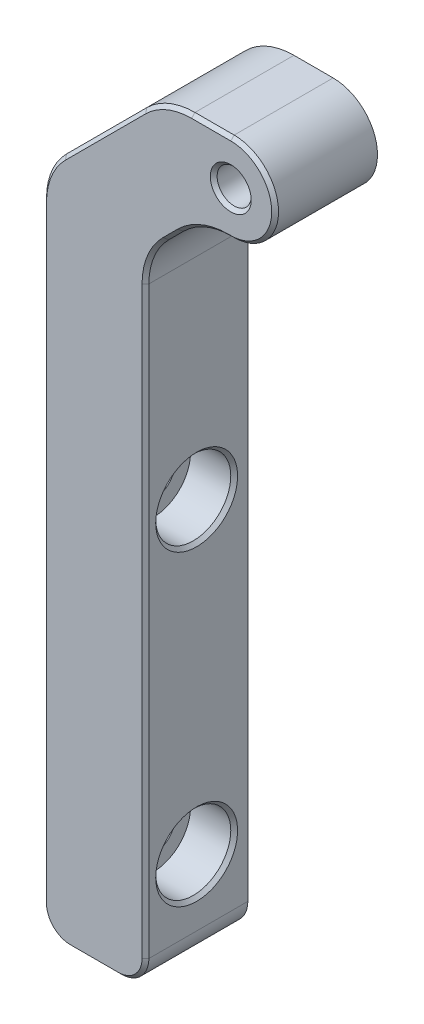
ISO-10303-21;
HEADER;
FILE_DESCRIPTION(('STEP AP214'),'2;1');
FILE_NAME('part.step','',(''),(''),'','','');
FILE_SCHEMA(('AUTOMOTIVE_DESIGN { 1 0 10303 214 1 1 1 1 }'));
ENDSEC;
DATA;
#1=APPLICATION_CONTEXT('core data for automotive mechanical design processes');
#2=APPLICATION_PROTOCOL_DEFINITION('international standard','automotive_design',2000,#1);
#3=PRODUCT_CONTEXT('',#1,'mechanical');
#4=PRODUCT('Part','Part','',(#3));
#5=PRODUCT_RELATED_PRODUCT_CATEGORY('part','',(#4));
#6=PRODUCT_DEFINITION_FORMATION('','',#4);
#7=PRODUCT_DEFINITION_CONTEXT('part definition',#1,'design');
#8=PRODUCT_DEFINITION('design','',#6,#7);
#9=PRODUCT_DEFINITION_SHAPE('','',#8);
#10=(LENGTH_UNIT() NAMED_UNIT(*) SI_UNIT(.MILLI.,.METRE.));
#11=(NAMED_UNIT(*) PLANE_ANGLE_UNIT() SI_UNIT($,.RADIAN.));
#12=(NAMED_UNIT(*) SI_UNIT($,.STERADIAN.) SOLID_ANGLE_UNIT());
#13=UNCERTAINTY_MEASURE_WITH_UNIT(LENGTH_MEASURE(1.E-05),#10,'distance_accuracy_value','');
#14=(GEOMETRIC_REPRESENTATION_CONTEXT(3) GLOBAL_UNCERTAINTY_ASSIGNED_CONTEXT((#13)) GLOBAL_UNIT_ASSIGNED_CONTEXT((#10,
#11,#12)) REPRESENTATION_CONTEXT('',''));
#15=CARTESIAN_POINT('',(0.,0.,0.));
#16=DIRECTION('',(0.,0.,1.));
#17=DIRECTION('',(1.,0.,0.));
#18=AXIS2_PLACEMENT_3D('',#15,#16,#17);
#19=CARTESIAN_POINT('',(26.4140960718114,32.7908047863379,15.));
#20=DIRECTION('',(0.,0.,-1.));
#21=DIRECTION('',(-1.,0.,0.));
#22=AXIS2_PLACEMENT_3D('',#19,#20,#21);
#23=CYLINDRICAL_SURFACE('',#22,6.49999999999695);
#24=DIRECTION('',(0.,0.,-1.));
#25=VECTOR('',#24,1.);
#26=CARTESIAN_POINT('',(26.4140960718114,39.2908047863348,15.));
#27=LINE('',#26,#25);
#28=CARTESIAN_POINT('',(26.4140960718114,39.2908047863348,14.5));
#29=VERTEX_POINT('',#28);
#30=CARTESIAN_POINT('',(26.4140960718114,39.2908047863348,0.));
#31=VERTEX_POINT('',#30);
#32=EDGE_CURVE('E177',#29,#31,#27,.T.);
#33=ORIENTED_EDGE('',*,*,#32,.F.);
#34=CARTESIAN_POINT('',(26.4140960718114,32.7908047863379,14.5));
#35=DIRECTION('',(0.,0.,1.));
#36=DIRECTION('',(1.,0.,0.));
#37=AXIS2_PLACEMENT_3D('',#34,#35,#36);
#38=CIRCLE('',#37,6.49999999999695);
#39=CARTESIAN_POINT('',(26.4140960718114,26.2908047863409,14.5));
#40=VERTEX_POINT('',#39);
#41=EDGE_CURVE('E323',#29,#40,#38,.F.);
#42=ORIENTED_EDGE('',*,*,#41,.T.);
#43=DIRECTION('',(0.,0.,-1.));
#44=VECTOR('',#43,1.);
#45=CARTESIAN_POINT('',(26.4140960718114,26.2908047863409,15.));
#46=LINE('',#45,#44);
#47=CARTESIAN_POINT('',(26.4140960718114,26.2908047863409,0.));
#48=VERTEX_POINT('',#47);
#49=EDGE_CURVE('E201',#40,#48,#46,.T.);
#50=ORIENTED_EDGE('',*,*,#49,.T.);
#51=CARTESIAN_POINT('',(26.4140960718114,32.7908047863379,0.));
#52=DIRECTION('',(0.,0.,1.));
#53=DIRECTION('',(1.,0.,0.));
#54=AXIS2_PLACEMENT_3D('',#51,#52,#53);
#55=CIRCLE('',#54,6.49999999999695);
#56=EDGE_CURVE('E195',#48,#31,#55,.T.);
#57=ORIENTED_EDGE('',*,*,#56,.T.);
#58=EDGE_LOOP('',(#33,#42,#50,#57));
#59=FACE_BOUND('',#58,.T.);
#60=ADVANCED_FACE('F32',(#59),#23,.T.);
#61=CARTESIAN_POINT('',(26.4140960718114,39.2908047863348,15.));
#62=DIRECTION('',(0.,-1.,0.));
#63=DIRECTION('',(0.,0.,-1.));
#64=AXIS2_PLACEMENT_3D('',#61,#62,#63);
#65=PLANE('',#64);
#66=DIRECTION('',(0.,0.,-1.));
#67=VECTOR('',#66,1.);
#68=CARTESIAN_POINT('',(20.6714553846794,39.2908047863348,15.));
#69=LINE('',#68,#67);
#70=CARTESIAN_POINT('',(20.6714553846794,39.2908047863348,14.5));
#71=VERTEX_POINT('',#70);
#72=CARTESIAN_POINT('',(20.6714553846794,39.2908047863348,0.));
#73=VERTEX_POINT('',#72);
#74=EDGE_CURVE('E189',#71,#73,#69,.T.);
#75=ORIENTED_EDGE('',*,*,#74,.F.);
#76=DIRECTION('',(1.,0.,0.));
#77=VECTOR('',#76,1.);
#78=CARTESIAN_POINT('',(26.4140960718114,39.2908047863348,14.5));
#79=LINE('',#78,#77);
#80=EDGE_CURVE('E184',#71,#29,#79,.T.);
#81=ORIENTED_EDGE('',*,*,#80,.T.);
#82=ORIENTED_EDGE('',*,*,#32,.T.);
#83=DIRECTION('',(-1.,0.,0.));
#84=VECTOR('',#83,1.);
#85=CARTESIAN_POINT('',(26.4140960718114,39.2908047863348,0.));
#86=LINE('',#85,#84);
#87=EDGE_CURVE('E181',#31,#73,#86,.T.);
#88=ORIENTED_EDGE('',*,*,#87,.T.);
#89=EDGE_LOOP('',(#75,#81,#82,#88));
#90=FACE_BOUND('',#89,.T.);
#91=ADVANCED_FACE('F180',(#90),#65,.F.);
#92=CARTESIAN_POINT('',(20.6714553846793,29.2908047863348,15.));
#93=DIRECTION('',(0.,0.,-1.));
#94=DIRECTION('',(-1.,0.,0.));
#95=AXIS2_PLACEMENT_3D('',#92,#93,#94);
#96=CYLINDRICAL_SURFACE('',#95,10.);
#97=DIRECTION('',(0.,0.,-1.));
#98=VECTOR('',#97,1.);
#99=CARTESIAN_POINT('',(13.6003875728138,36.3618725982003,15.));
#100=LINE('',#99,#98);
#101=CARTESIAN_POINT('',(13.6003875728138,36.3618725982003,14.5));
#102=VERTEX_POINT('',#101);
#103=CARTESIAN_POINT('',(13.6003875728138,36.3618725982003,0.));
#104=VERTEX_POINT('',#103);
#105=EDGE_CURVE('E264',#102,#104,#100,.T.);
#106=ORIENTED_EDGE('',*,*,#105,.F.);
#107=CARTESIAN_POINT('',(20.6714553846793,29.2908047863348,14.5));
#108=DIRECTION('',(0.,0.,1.));
#109=DIRECTION('',(1.,0.,0.));
#110=AXIS2_PLACEMENT_3D('',#107,#108,#109);
#111=CIRCLE('',#110,10.);
#112=EDGE_CURVE('E315',#102,#71,#111,.F.);
#113=ORIENTED_EDGE('',*,*,#112,.T.);
#114=ORIENTED_EDGE('',*,*,#74,.T.);
#115=CARTESIAN_POINT('',(20.6714553846793,29.2908047863348,0.));
#116=DIRECTION('',(0.,0.,1.));
#117=DIRECTION('',(1.,0.,0.));
#118=AXIS2_PLACEMENT_3D('',#115,#116,#117);
#119=CIRCLE('',#118,10.);
#120=EDGE_CURVE('E198',#73,#104,#119,.T.);
#121=ORIENTED_EDGE('',*,*,#120,.T.);
#122=EDGE_LOOP('',(#106,#113,#114,#121));
#123=FACE_BOUND('',#122,.T.);
#124=ADVANCED_FACE('F432',(#123),#96,.T.);
#125=CARTESIAN_POINT('',(13.6003875728138,36.3618725982003,15.));
#126=DIRECTION('',(0.707106781186547,-0.707106781186547,0.));
#127=DIRECTION('',(0.707106781186548,0.707106781186548,0.));
#128=AXIS2_PLACEMENT_3D('',#125,#126,#127);
#129=PLANE('',#128);
#130=DIRECTION('',(0.,0.,-1.));
#131=VECTOR('',#130,1.);
#132=CARTESIAN_POINT('',(1.84302825994298,24.6045132853294,15.));
#133=LINE('',#132,#131);
#134=CARTESIAN_POINT('',(1.84302825994298,24.6045132853294,14.5));
#135=VERTEX_POINT('',#134);
#136=CARTESIAN_POINT('',(1.84302825994298,24.6045132853294,0.));
#137=VERTEX_POINT('',#136);
#138=EDGE_CURVE('E262',#135,#137,#133,.T.);
#139=ORIENTED_EDGE('',*,*,#138,.F.);
#140=DIRECTION('',(0.707106781186548,0.707106781186548,0.));
#141=VECTOR('',#140,1.);
#142=CARTESIAN_POINT('',(13.6003875728138,36.3618725982003,14.5));
#143=LINE('',#142,#141);
#144=EDGE_CURVE('E318',#135,#102,#143,.T.);
#145=ORIENTED_EDGE('',*,*,#144,.T.);
#146=ORIENTED_EDGE('',*,*,#105,.T.);
#147=DIRECTION('',(-0.707106781186547,-0.707106781186547,0.));
#148=VECTOR('',#147,1.);
#149=CARTESIAN_POINT('',(13.6003875728138,36.3618725982003,0.));
#150=LINE('',#149,#148);
#151=EDGE_CURVE('E211',#104,#137,#150,.T.);
#152=ORIENTED_EDGE('',*,*,#151,.T.);
#153=EDGE_LOOP('',(#139,#145,#146,#152));
#154=FACE_BOUND('',#153,.T.);
#155=ADVANCED_FACE('F548',(#154),#129,.F.);
#156=CARTESIAN_POINT('',(8.91409607180843,17.5334454734639,15.));
#157=DIRECTION('',(0.,0.,-1.));
#158=DIRECTION('',(-1.,0.,0.));
#159=AXIS2_PLACEMENT_3D('',#156,#157,#158);
#160=CYLINDRICAL_SURFACE('',#159,10.);
#161=DIRECTION('',(0.,0.,-1.));
#162=VECTOR('',#161,1.);
#163=CARTESIAN_POINT('',(-1.08590392819157,17.5334454734639,15.));
#164=LINE('',#163,#162);
#165=CARTESIAN_POINT('',(-1.08590392819157,17.5334454734639,14.5));
#166=VERTEX_POINT('',#165);
#167=CARTESIAN_POINT('',(-1.08590392819157,17.5334454734639,0.));
#168=VERTEX_POINT('',#167);
#169=EDGE_CURVE('E260',#166,#168,#164,.T.);
#170=ORIENTED_EDGE('',*,*,#169,.F.);
#171=CARTESIAN_POINT('',(8.91409607180843,17.5334454734639,14.5));
#172=DIRECTION('',(0.,0.,1.));
#173=DIRECTION('',(1.,0.,0.));
#174=AXIS2_PLACEMENT_3D('',#171,#172,#173);
#175=CIRCLE('',#174,10.);
#176=EDGE_CURVE('E321',#166,#135,#175,.F.);
#177=ORIENTED_EDGE('',*,*,#176,.T.);
#178=ORIENTED_EDGE('',*,*,#138,.T.);
#179=CARTESIAN_POINT('',(8.91409607180843,17.5334454734639,0.));
#180=DIRECTION('',(0.,0.,1.));
#181=DIRECTION('',(1.,0.,0.));
#182=AXIS2_PLACEMENT_3D('',#179,#180,#181);
#183=CIRCLE('',#182,10.);
#184=EDGE_CURVE('E214',#137,#168,#183,.T.);
#185=ORIENTED_EDGE('',*,*,#184,.T.);
#186=EDGE_LOOP('',(#170,#177,#178,#185));
#187=FACE_BOUND('',#186,.T.);
#188=ADVANCED_FACE('F544',(#187),#160,.T.);
#189=CARTESIAN_POINT('',(-1.08590392819158,-71.4592049495357,15.));
#190=DIRECTION('',(1.,0.,0.));
#191=DIRECTION('',(0.,0.,-1.));
#192=AXIS2_PLACEMENT_3D('',#189,#190,#191);
#193=PLANE('',#192);
#194=CARTESIAN_POINT('',(-1.08590392819158,-16.7091952136652,7.49999999999999));
#195=DIRECTION('',(1.,0.,0.));
#196=DIRECTION('',(0.,0.,-1.));
#197=AXIS2_PLACEMENT_3D('',#194,#195,#196);
#198=CIRCLE('',#197,3.3);
#199=CARTESIAN_POINT('',(-1.08590392819158,-16.7091952136652,4.19999999999999));
#200=VERTEX_POINT('',#199);
#201=EDGE_CURVE('E387',#200,#200,#198,.T.);
#202=ORIENTED_EDGE('',*,*,#201,.T.);
#203=EDGE_LOOP('',(#202));
#204=FACE_BOUND('',#203,.T.);
#205=CARTESIAN_POINT('',(-1.08590392819158,-61.7091952136652,7.49999999999999));
#206=DIRECTION('',(1.,0.,0.));
#207=DIRECTION('',(0.,0.,-1.));
#208=AXIS2_PLACEMENT_3D('',#205,#206,#207);
#209=CIRCLE('',#208,3.3);
#210=CARTESIAN_POINT('',(-1.08590392819158,-61.7091952136652,4.19999999999999));
#211=VERTEX_POINT('',#210);
#212=EDGE_CURVE('E206',#211,#211,#209,.T.);
#213=ORIENTED_EDGE('',*,*,#212,.T.);
#214=EDGE_LOOP('',(#213));
#215=FACE_BOUND('',#214,.T.);
#216=DIRECTION('',(0.,0.,-1.));
#217=VECTOR('',#216,1.);
#218=CARTESIAN_POINT('',(-1.08590392819158,-71.4592049495357,15.));
#219=LINE('',#218,#217);
#220=CARTESIAN_POINT('',(-1.08590392819158,-71.4592049495357,14.5));
#221=VERTEX_POINT('',#220);
#222=CARTESIAN_POINT('',(-1.08590392819158,-71.4592049495357,0.));
#223=VERTEX_POINT('',#222);
#224=EDGE_CURVE('E258',#221,#223,#219,.T.);
#225=ORIENTED_EDGE('',*,*,#224,.F.);
#226=DIRECTION('',(0.,1.,0.));
#227=VECTOR('',#226,1.);
#228=CARTESIAN_POINT('',(-1.08590392819158,17.5334454734639,14.5));
#229=LINE('',#228,#227);
#230=EDGE_CURVE('E325',#221,#166,#229,.T.);
#231=ORIENTED_EDGE('',*,*,#230,.T.);
#232=ORIENTED_EDGE('',*,*,#169,.T.);
#233=DIRECTION('',(0.,-1.,0.));
#234=VECTOR('',#233,1.);
#235=CARTESIAN_POINT('',(-1.08590392819158,-71.4592049495357,0.));
#236=LINE('',#235,#234);
#237=EDGE_CURVE('E217',#168,#223,#236,.T.);
#238=ORIENTED_EDGE('',*,*,#237,.T.);
#239=EDGE_LOOP('',(#225,#231,#232,#238));
#240=FACE_BOUND('',#239,.T.);
#241=ADVANCED_FACE('F400',(#204,#215,#240),#193,.F.);
#242=CARTESIAN_POINT('',(2.91409607180843,-71.4592049495357,15.));
#243=DIRECTION('',(0.,0.,-1.));
#244=DIRECTION('',(-1.,0.,0.));
#245=AXIS2_PLACEMENT_3D('',#242,#243,#244);
#246=CYLINDRICAL_SURFACE('',#245,4.);
#247=DIRECTION('',(0.,0.,-1.));
#248=VECTOR('',#247,1.);
#249=CARTESIAN_POINT('',(2.91409607180843,-75.4592049495357,15.));
#250=LINE('',#249,#248);
#251=CARTESIAN_POINT('',(2.91409607180843,-75.4592049495357,14.5));
#252=VERTEX_POINT('',#251);
#253=CARTESIAN_POINT('',(2.91409607180843,-75.4592049495357,0.));
#254=VERTEX_POINT('',#253);
#255=EDGE_CURVE('E256',#252,#254,#250,.T.);
#256=ORIENTED_EDGE('',*,*,#255,.F.);
#257=CARTESIAN_POINT('',(2.91409607180843,-71.4592049495357,14.5));
#258=DIRECTION('',(0.,0.,1.));
#259=DIRECTION('',(1.,0.,0.));
#260=AXIS2_PLACEMENT_3D('',#257,#258,#259);
#261=CIRCLE('',#260,4.);
#262=EDGE_CURVE('E329',#252,#221,#261,.F.);
#263=ORIENTED_EDGE('',*,*,#262,.T.);
#264=ORIENTED_EDGE('',*,*,#224,.T.);
#265=CARTESIAN_POINT('',(2.91409607180843,-71.4592049495357,0.));
#266=DIRECTION('',(0.,0.,1.));
#267=DIRECTION('',(-1.,0.,0.));
#268=AXIS2_PLACEMENT_3D('',#265,#266,#267);
#269=CIRCLE('',#268,4.);
#270=EDGE_CURVE('E220',#223,#254,#269,.T.);
#271=ORIENTED_EDGE('',*,*,#270,.T.);
#272=EDGE_LOOP('',(#256,#263,#264,#271));
#273=FACE_BOUND('',#272,.T.);
#274=ADVANCED_FACE('F514',(#273),#246,.T.);
#275=CARTESIAN_POINT('',(2.91409607180843,-75.4592049495357,15.));
#276=DIRECTION('',(0.,1.,0.));
#277=DIRECTION('',(0.,0.,1.));
#278=AXIS2_PLACEMENT_3D('',#275,#276,#277);
#279=PLANE('',#278);
#280=DIRECTION('',(0.,0.,-1.));
#281=VECTOR('',#280,1.);
#282=CARTESIAN_POINT('',(9.91409607180471,-75.4592049495357,15.));
#283=LINE('',#282,#281);
#284=CARTESIAN_POINT('',(9.91409607180471,-75.4592049495357,14.5));
#285=VERTEX_POINT('',#284);
#286=CARTESIAN_POINT('',(9.91409607180471,-75.4592049495357,0.));
#287=VERTEX_POINT('',#286);
#288=EDGE_CURVE('E254',#285,#287,#283,.T.);
#289=ORIENTED_EDGE('',*,*,#288,.F.);
#290=DIRECTION('',(-1.,0.,0.));
#291=VECTOR('',#290,1.);
#292=CARTESIAN_POINT('',(2.91409607180843,-75.4592049495357,14.5));
#293=LINE('',#292,#291);
#294=EDGE_CURVE('E333',#285,#252,#293,.T.);
#295=ORIENTED_EDGE('',*,*,#294,.T.);
#296=ORIENTED_EDGE('',*,*,#255,.T.);
#297=DIRECTION('',(1.,0.,0.));
#298=VECTOR('',#297,1.);
#299=CARTESIAN_POINT('',(2.91409607180843,-75.4592049495357,0.));
#300=LINE('',#299,#298);
#301=EDGE_CURVE('E223',#254,#287,#300,.T.);
#302=ORIENTED_EDGE('',*,*,#301,.T.);
#303=EDGE_LOOP('',(#289,#295,#296,#302));
#304=FACE_BOUND('',#303,.T.);
#305=ADVANCED_FACE('F512',(#304),#279,.F.);
#306=CARTESIAN_POINT('',(9.91409607180471,-71.4592049495357,15.));
#307=DIRECTION('',(0.,0.,-1.));
#308=DIRECTION('',(-1.,0.,0.));
#309=AXIS2_PLACEMENT_3D('',#306,#307,#308);
#310=CYLINDRICAL_SURFACE('',#309,4.);
#311=DIRECTION('',(0.,0.,-1.));
#312=VECTOR('',#311,1.);
#313=CARTESIAN_POINT('',(13.9140960718047,-71.4592049495357,15.));
#314=LINE('',#313,#312);
#315=CARTESIAN_POINT('',(13.9140960718047,-71.4592049495357,14.5));
#316=VERTEX_POINT('',#315);
#317=CARTESIAN_POINT('',(13.9140960718047,-71.4592049495357,0.));
#318=VERTEX_POINT('',#317);
#319=EDGE_CURVE('E252',#316,#318,#314,.T.);
#320=ORIENTED_EDGE('',*,*,#319,.F.);
#321=CARTESIAN_POINT('',(9.91409607180471,-71.4592049495357,14.5));
#322=DIRECTION('',(0.,0.,1.));
#323=DIRECTION('',(1.,0.,0.));
#324=AXIS2_PLACEMENT_3D('',#321,#322,#323);
#325=CIRCLE('',#324,4.);
#326=EDGE_CURVE('E41',#316,#285,#325,.F.);
#327=ORIENTED_EDGE('',*,*,#326,.T.);
#328=ORIENTED_EDGE('',*,*,#288,.T.);
#329=CARTESIAN_POINT('',(9.91409607180471,-71.4592049495357,0.));
#330=DIRECTION('',(0.,0.,1.));
#331=DIRECTION('',(1.,0.,0.));
#332=AXIS2_PLACEMENT_3D('',#329,#330,#331);
#333=CIRCLE('',#332,4.);
#334=EDGE_CURVE('E226',#287,#318,#333,.T.);
#335=ORIENTED_EDGE('',*,*,#334,.T.);
#336=EDGE_LOOP('',(#320,#327,#328,#335));
#337=FACE_BOUND('',#336,.T.);
#338=ADVANCED_FACE('F522',(#337),#310,.T.);
#339=CARTESIAN_POINT('',(13.9140960718047,-71.4592049495357,15.));
#340=DIRECTION('',(-1.,0.,0.));
#341=DIRECTION('',(0.,0.,1.));
#342=AXIS2_PLACEMENT_3D('',#339,#340,#341);
#343=PLANE('',#342);
#344=CARTESIAN_POINT('',(13.9140960718047,-61.7091952136652,7.49999999999999));
#345=DIRECTION('',(-1.,0.,0.));
#346=DIRECTION('',(0.,0.,1.));
#347=AXIS2_PLACEMENT_3D('',#344,#345,#346);
#348=CIRCLE('',#347,5.99999999999998);
#349=CARTESIAN_POINT('',(13.9140960718047,-61.7091952136652,13.5));
#350=VERTEX_POINT('',#349);
#351=EDGE_CURVE('E274',#350,#350,#348,.T.);
#352=ORIENTED_EDGE('',*,*,#351,.T.);
#353=EDGE_LOOP('',(#352));
#354=FACE_BOUND('',#353,.T.);
#355=CARTESIAN_POINT('',(13.9140960718047,-16.7091952136652,7.49999999999999));
#356=DIRECTION('',(-1.,0.,0.));
#357=DIRECTION('',(0.,0.,1.));
#358=AXIS2_PLACEMENT_3D('',#355,#356,#357);
#359=CIRCLE('',#358,5.99999999999998);
#360=CARTESIAN_POINT('',(13.9140960718047,-16.7091952136652,13.5));
#361=VERTEX_POINT('',#360);
#362=EDGE_CURVE('E271',#361,#361,#359,.T.);
#363=ORIENTED_EDGE('',*,*,#362,.T.);
#364=EDGE_LOOP('',(#363));
#365=FACE_BOUND('',#364,.T.);
#366=DIRECTION('',(0.,0.,-1.));
#367=VECTOR('',#366,1.);
#368=CARTESIAN_POINT('',(13.9140960718047,14.1486691626099,15.));
#369=LINE('',#368,#367);
#370=CARTESIAN_POINT('',(13.9140960718047,14.1486691626099,14.5));
#371=VERTEX_POINT('',#370);
#372=CARTESIAN_POINT('',(13.9140960718047,14.1486691626099,0.));
#373=VERTEX_POINT('',#372);
#374=EDGE_CURVE('E250',#371,#373,#369,.T.);
#375=ORIENTED_EDGE('',*,*,#374,.F.);
#376=DIRECTION('',(0.,-1.,0.));
#377=VECTOR('',#376,1.);
#378=CARTESIAN_POINT('',(13.9140960718047,-71.4592049495357,14.5));
#379=LINE('',#378,#377);
#380=EDGE_CURVE('E269',#371,#316,#379,.T.);
#381=ORIENTED_EDGE('',*,*,#380,.T.);
#382=ORIENTED_EDGE('',*,*,#319,.T.);
#383=DIRECTION('',(0.,1.,0.));
#384=VECTOR('',#383,1.);
#385=CARTESIAN_POINT('',(13.9140960718047,-71.4592049495357,0.));
#386=LINE('',#385,#384);
#387=EDGE_CURVE('E229',#318,#373,#386,.T.);
#388=ORIENTED_EDGE('',*,*,#387,.T.);
#389=EDGE_LOOP('',(#375,#381,#382,#388));
#390=FACE_BOUND('',#389,.T.);
#391=ADVANCED_FACE('F525',(#354,#365,#390),#343,.F.);
#392=CARTESIAN_POINT('',(23.9140960718047,14.14866916261,15.));
#393=DIRECTION('',(0.,0.,-1.));
#394=DIRECTION('',(-1.,0.,0.));
#395=AXIS2_PLACEMENT_3D('',#392,#393,#394);
#396=CYLINDRICAL_SURFACE('',#395,10.);
#397=DIRECTION('',(0.,0.,-1.));
#398=VECTOR('',#397,1.);
#399=CARTESIAN_POINT('',(16.8430282599393,21.2197369744755,15.));
#400=LINE('',#399,#398);
#401=CARTESIAN_POINT('',(16.8430282599393,21.2197369744755,14.5));
#402=VERTEX_POINT('',#401);
#403=CARTESIAN_POINT('',(16.8430282599393,21.2197369744755,0.));
#404=VERTEX_POINT('',#403);
#405=EDGE_CURVE('E248',#402,#404,#400,.T.);
#406=ORIENTED_EDGE('',*,*,#405,.F.);
#407=CARTESIAN_POINT('',(23.9140960718047,14.14866916261,14.5));
#408=DIRECTION('',(0.,0.,1.));
#409=DIRECTION('',(1.,0.,0.));
#410=AXIS2_PLACEMENT_3D('',#407,#408,#409);
#411=CIRCLE('',#410,10.);
#412=EDGE_CURVE('E11',#402,#371,#411,.T.);
#413=ORIENTED_EDGE('',*,*,#412,.T.);
#414=ORIENTED_EDGE('',*,*,#374,.T.);
#415=CARTESIAN_POINT('',(23.9140960718047,14.14866916261,0.));
#416=DIRECTION('',(0.,0.,-1.));
#417=DIRECTION('',(1.,0.,0.));
#418=AXIS2_PLACEMENT_3D('',#415,#416,#417);
#419=CIRCLE('',#418,10.);
#420=EDGE_CURVE('E232',#373,#404,#419,.T.);
#421=ORIENTED_EDGE('',*,*,#420,.T.);
#422=EDGE_LOOP('',(#406,#413,#414,#421));
#423=FACE_BOUND('',#422,.T.);
#424=ADVANCED_FACE('F527',(#423),#396,.F.);
#425=CARTESIAN_POINT('',(16.8430282599393,21.2197369744755,15.));
#426=DIRECTION('',(-0.707106781186547,0.707106781186547,0.));
#427=DIRECTION('',(-0.707106781186548,-0.707106781186548,0.));
#428=AXIS2_PLACEMENT_3D('',#425,#426,#427);
#429=PLANE('',#428);
#430=DIRECTION('',(0.,0.,-1.));
#431=VECTOR('',#430,1.);
#432=CARTESIAN_POINT('',(18.9851638836702,23.3618725982064,15.));
#433=LINE('',#432,#431);
#434=CARTESIAN_POINT('',(18.9851638836702,23.3618725982064,14.5));
#435=VERTEX_POINT('',#434);
#436=CARTESIAN_POINT('',(18.9851638836702,23.3618725982064,0.));
#437=VERTEX_POINT('',#436);
#438=EDGE_CURVE('E246',#435,#437,#433,.T.);
#439=ORIENTED_EDGE('',*,*,#438,.F.);
#440=DIRECTION('',(-0.707106781186548,-0.707106781186548,0.));
#441=VECTOR('',#440,1.);
#442=CARTESIAN_POINT('',(16.8430282599393,21.2197369744755,14.5));
#443=LINE('',#442,#441);
#444=EDGE_CURVE('E49',#435,#402,#443,.T.);
#445=ORIENTED_EDGE('',*,*,#444,.T.);
#446=ORIENTED_EDGE('',*,*,#405,.T.);
#447=DIRECTION('',(0.707106781186548,0.707106781186548,0.));
#448=VECTOR('',#447,1.);
#449=CARTESIAN_POINT('',(16.8430282599393,21.2197369744755,0.));
#450=LINE('',#449,#448);
#451=EDGE_CURVE('E235',#404,#437,#450,.T.);
#452=ORIENTED_EDGE('',*,*,#451,.T.);
#453=EDGE_LOOP('',(#439,#445,#446,#452));
#454=FACE_BOUND('',#453,.T.);
#455=ADVANCED_FACE('F571',(#454),#429,.F.);
#456=CARTESIAN_POINT('',(26.0562316955357,16.2908047863409,15.));
#457=DIRECTION('',(0.,0.,-1.));
#458=DIRECTION('',(-1.,0.,0.));
#459=AXIS2_PLACEMENT_3D('',#456,#457,#458);
#460=CYLINDRICAL_SURFACE('',#459,10.);
#461=DIRECTION('',(0.,0.,-1.));
#462=VECTOR('',#461,1.);
#463=CARTESIAN_POINT('',(26.0562316955357,26.2908047863409,15.));
#464=LINE('',#463,#462);
#465=CARTESIAN_POINT('',(26.0562316955357,26.2908047863409,14.5));
#466=VERTEX_POINT('',#465);
#467=CARTESIAN_POINT('',(26.0562316955357,26.2908047863409,0.));
#468=VERTEX_POINT('',#467);
#469=EDGE_CURVE('E244',#466,#468,#464,.T.);
#470=ORIENTED_EDGE('',*,*,#469,.F.);
#471=CARTESIAN_POINT('',(26.0562316955357,16.2908047863409,14.5));
#472=DIRECTION('',(0.,0.,1.));
#473=DIRECTION('',(1.,0.,0.));
#474=AXIS2_PLACEMENT_3D('',#471,#472,#473);
#475=CIRCLE('',#474,10.);
#476=EDGE_CURVE('E331',#466,#435,#475,.T.);
#477=ORIENTED_EDGE('',*,*,#476,.T.);
#478=ORIENTED_EDGE('',*,*,#438,.T.);
#479=CARTESIAN_POINT('',(26.0562316955357,16.2908047863409,0.));
#480=DIRECTION('',(0.,0.,-1.));
#481=DIRECTION('',(-1.,0.,0.));
#482=AXIS2_PLACEMENT_3D('',#479,#480,#481);
#483=CIRCLE('',#482,10.);
#484=EDGE_CURVE('E238',#437,#468,#483,.T.);
#485=ORIENTED_EDGE('',*,*,#484,.T.);
#486=EDGE_LOOP('',(#470,#477,#478,#485));
#487=FACE_BOUND('',#486,.T.);
#488=ADVANCED_FACE('F570',(#487),#460,.F.);
#489=CARTESIAN_POINT('',(26.4140960718114,26.2908047863409,15.));
#490=DIRECTION('',(0.,1.,0.));
#491=DIRECTION('',(0.,0.,1.));
#492=AXIS2_PLACEMENT_3D('',#489,#490,#491);
#493=PLANE('',#492);
#494=ORIENTED_EDGE('',*,*,#49,.F.);
#495=DIRECTION('',(-1.,0.,0.));
#496=VECTOR('',#495,1.);
#497=CARTESIAN_POINT('',(26.0562316955357,26.2908047863409,14.5));
#498=LINE('',#497,#496);
#499=EDGE_CURVE('E327',#40,#466,#498,.T.);
#500=ORIENTED_EDGE('',*,*,#499,.T.);
#501=ORIENTED_EDGE('',*,*,#469,.T.);
#502=DIRECTION('',(1.,0.,0.));
#503=VECTOR('',#502,1.);
#504=CARTESIAN_POINT('',(26.4140960718114,26.2908047863409,0.));
#505=LINE('',#504,#503);
#506=EDGE_CURVE('E241',#468,#48,#505,.T.);
#507=ORIENTED_EDGE('',*,*,#506,.T.);
#508=EDGE_LOOP('',(#494,#500,#501,#507));
#509=FACE_BOUND('',#508,.T.);
#510=ADVANCED_FACE('F565',(#509),#493,.F.);
#511=CARTESIAN_POINT('',(26.4140960718114,32.7908047863379,15.));
#512=DIRECTION('',(0.,0.,1.));
#513=DIRECTION('',(1.,0.,0.));
#514=AXIS2_PLACEMENT_3D('',#511,#512,#513);
#515=PLANE('',#514);
#516=CARTESIAN_POINT('',(26.4140960718114,32.7908047863379,15.));
#517=DIRECTION('',(0.,0.,1.));
#518=DIRECTION('',(1.,0.,0.));
#519=AXIS2_PLACEMENT_3D('',#516,#517,#518);
#520=CIRCLE('',#519,2.99999999999999);
#521=CARTESIAN_POINT('',(29.4140960718114,32.7908047863379,15.));
#522=VERTEX_POINT('',#521);
#523=EDGE_CURVE('E312',#522,#522,#520,.F.);
#524=ORIENTED_EDGE('',*,*,#523,.T.);
#525=EDGE_LOOP('',(#524));
#526=FACE_BOUND('',#525,.T.);
#527=DIRECTION('',(-1.,0.,0.));
#528=VECTOR('',#527,1.);
#529=CARTESIAN_POINT('',(20.6714553846794,38.7908047863348,15.));
#530=LINE('',#529,#528);
#531=CARTESIAN_POINT('',(26.4140960718114,38.7908047863348,15.));
#532=VERTEX_POINT('',#531);
#533=CARTESIAN_POINT('',(20.6714553846794,38.7908047863348,15.));
#534=VERTEX_POINT('',#533);
#535=EDGE_CURVE('E305',#532,#534,#530,.T.);
#536=ORIENTED_EDGE('',*,*,#535,.T.);
#537=CARTESIAN_POINT('',(20.6714553846793,29.2908047863348,15.));
#538=DIRECTION('',(0.,0.,1.));
#539=DIRECTION('',(1.,0.,0.));
#540=AXIS2_PLACEMENT_3D('',#537,#538,#539);
#541=CIRCLE('',#540,9.50000000000001);
#542=CARTESIAN_POINT('',(13.9539409634071,36.008319207607,15.));
#543=VERTEX_POINT('',#542);
#544=EDGE_CURVE('E309',#534,#543,#541,.T.);
#545=ORIENTED_EDGE('',*,*,#544,.T.);
#546=DIRECTION('',(-0.707106781186548,-0.707106781186548,0.));
#547=VECTOR('',#546,1.);
#548=CARTESIAN_POINT('',(2.19658165053625,24.2509598947361,15.));
#549=LINE('',#548,#547);
#550=CARTESIAN_POINT('',(2.19658165053625,24.2509598947361,15.));
#551=VERTEX_POINT('',#550);
#552=EDGE_CURVE('E307',#543,#551,#549,.T.);
#553=ORIENTED_EDGE('',*,*,#552,.T.);
#554=CARTESIAN_POINT('',(8.91409607180843,17.5334454734639,15.));
#555=DIRECTION('',(0.,0.,1.));
#556=DIRECTION('',(1.,0.,0.));
#557=AXIS2_PLACEMENT_3D('',#554,#555,#556);
#558=CIRCLE('',#557,9.50000000000001);
#559=CARTESIAN_POINT('',(-0.585903928191578,17.5334454734639,15.));
#560=VERTEX_POINT('',#559);
#561=EDGE_CURVE('E303',#551,#560,#558,.T.);
#562=ORIENTED_EDGE('',*,*,#561,.T.);
#563=DIRECTION('',(0.,-1.,0.));
#564=VECTOR('',#563,1.);
#565=CARTESIAN_POINT('',(-0.585903928191578,-71.4592049495357,15.));
#566=LINE('',#565,#564);
#567=CARTESIAN_POINT('',(-0.585903928191578,-71.4592049495357,15.));
#568=VERTEX_POINT('',#567);
#569=EDGE_CURVE('E299',#560,#568,#566,.T.);
#570=ORIENTED_EDGE('',*,*,#569,.T.);
#571=CARTESIAN_POINT('',(2.91409607180843,-71.4592049495357,15.));
#572=DIRECTION('',(0.,0.,1.));
#573=DIRECTION('',(1.,0.,0.));
#574=AXIS2_PLACEMENT_3D('',#571,#572,#573);
#575=CIRCLE('',#574,3.5);
#576=CARTESIAN_POINT('',(2.91409607180843,-74.9592049495357,15.));
#577=VERTEX_POINT('',#576);
#578=EDGE_CURVE('E295',#568,#577,#575,.T.);
#579=ORIENTED_EDGE('',*,*,#578,.T.);
#580=DIRECTION('',(1.,0.,0.));
#581=VECTOR('',#580,1.);
#582=CARTESIAN_POINT('',(9.91409607180471,-74.9592049495357,15.));
#583=LINE('',#582,#581);
#584=CARTESIAN_POINT('',(9.91409607180471,-74.9592049495357,15.));
#585=VERTEX_POINT('',#584);
#586=EDGE_CURVE('E291',#577,#585,#583,.T.);
#587=ORIENTED_EDGE('',*,*,#586,.T.);
#588=CARTESIAN_POINT('',(9.91409607180471,-71.4592049495357,15.));
#589=DIRECTION('',(0.,0.,1.));
#590=DIRECTION('',(1.,0.,0.));
#591=AXIS2_PLACEMENT_3D('',#588,#589,#590);
#592=CIRCLE('',#591,3.5);
#593=CARTESIAN_POINT('',(13.4140960718047,-71.4592049495357,15.));
#594=VERTEX_POINT('',#593);
#595=EDGE_CURVE('E287',#585,#594,#592,.T.);
#596=ORIENTED_EDGE('',*,*,#595,.T.);
#597=DIRECTION('',(0.,1.,0.));
#598=VECTOR('',#597,1.);
#599=CARTESIAN_POINT('',(13.4140960718047,14.1486691626099,15.));
#600=LINE('',#599,#598);
#601=CARTESIAN_POINT('',(13.4140960718047,14.1486691626099,15.));
#602=VERTEX_POINT('',#601);
#603=EDGE_CURVE('E283',#594,#602,#600,.T.);
#604=ORIENTED_EDGE('',*,*,#603,.T.);
#605=CARTESIAN_POINT('',(23.9140960718047,14.14866916261,15.));
#606=DIRECTION('',(0.,0.,1.));
#607=DIRECTION('',(1.,0.,0.));
#608=AXIS2_PLACEMENT_3D('',#605,#606,#607);
#609=CIRCLE('',#608,10.5);
#610=CARTESIAN_POINT('',(16.489474869346,21.5732903650688,15.));
#611=VERTEX_POINT('',#610);
#612=EDGE_CURVE('E285',#602,#611,#609,.F.);
#613=ORIENTED_EDGE('',*,*,#612,.T.);
#614=DIRECTION('',(0.707106781186548,0.707106781186548,0.));
#615=VECTOR('',#614,1.);
#616=CARTESIAN_POINT('',(18.6316104930769,23.7154259887997,15.));
#617=LINE('',#616,#615);
#618=CARTESIAN_POINT('',(18.6316104930769,23.7154259887997,15.));
#619=VERTEX_POINT('',#618);
#620=EDGE_CURVE('E289',#611,#619,#617,.T.);
#621=ORIENTED_EDGE('',*,*,#620,.T.);
#622=CARTESIAN_POINT('',(26.0562316955357,16.2908047863409,15.));
#623=DIRECTION('',(0.,0.,1.));
#624=DIRECTION('',(1.,0.,0.));
#625=AXIS2_PLACEMENT_3D('',#622,#623,#624);
#626=CIRCLE('',#625,10.5);
#627=CARTESIAN_POINT('',(26.0562316955357,26.7908047863409,15.));
#628=VERTEX_POINT('',#627);
#629=EDGE_CURVE('E293',#619,#628,#626,.F.);
#630=ORIENTED_EDGE('',*,*,#629,.T.);
#631=DIRECTION('',(1.,0.,0.));
#632=VECTOR('',#631,1.);
#633=CARTESIAN_POINT('',(26.4140960718114,26.7908047863409,15.));
#634=LINE('',#633,#632);
#635=CARTESIAN_POINT('',(26.4140960718114,26.7908047863409,15.));
#636=VERTEX_POINT('',#635);
#637=EDGE_CURVE('E297',#628,#636,#634,.T.);
#638=ORIENTED_EDGE('',*,*,#637,.T.);
#639=CARTESIAN_POINT('',(26.4140960718114,32.7908047863379,15.));
#640=DIRECTION('',(0.,0.,1.));
#641=DIRECTION('',(1.,0.,0.));
#642=AXIS2_PLACEMENT_3D('',#639,#640,#641);
#643=CIRCLE('',#642,5.99999999999695);
#644=EDGE_CURVE('E301',#636,#532,#643,.T.);
#645=ORIENTED_EDGE('',*,*,#644,.T.);
#646=EDGE_LOOP('',(#536,#545,#553,#562,#570,#579,#587,#596,#604,#613,#621,#630,#638,#645));
#647=FACE_BOUND('',#646,.T.);
#648=ADVANCED_FACE('F534',(#526,#647),#515,.T.);
#649=CARTESIAN_POINT('',(26.4140960718114,32.7908047863379,0.));
#650=DIRECTION('',(0.,0.,1.));
#651=DIRECTION('',(1.,0.,0.));
#652=AXIS2_PLACEMENT_3D('',#649,#650,#651);
#653=PLANE('',#652);
#654=CARTESIAN_POINT('',(26.4140960718114,32.7908047863379,0.));
#655=DIRECTION('',(0.,0.,1.));
#656=DIRECTION('',(1.,0.,0.));
#657=AXIS2_PLACEMENT_3D('',#654,#655,#656);
#658=CIRCLE('',#657,2.5);
#659=CARTESIAN_POINT('',(28.9140960718114,32.7908047863379,0.));
#660=VERTEX_POINT('',#659);
#661=EDGE_CURVE('E203',#660,#660,#658,.T.);
#662=ORIENTED_EDGE('',*,*,#661,.T.);
#663=EDGE_LOOP('',(#662));
#664=FACE_BOUND('',#663,.T.);
#665=ORIENTED_EDGE('',*,*,#56,.F.);
#666=ORIENTED_EDGE('',*,*,#506,.F.);
#667=ORIENTED_EDGE('',*,*,#484,.F.);
#668=ORIENTED_EDGE('',*,*,#451,.F.);
#669=ORIENTED_EDGE('',*,*,#420,.F.);
#670=ORIENTED_EDGE('',*,*,#387,.F.);
#671=ORIENTED_EDGE('',*,*,#334,.F.);
#672=ORIENTED_EDGE('',*,*,#301,.F.);
#673=ORIENTED_EDGE('',*,*,#270,.F.);
#674=ORIENTED_EDGE('',*,*,#237,.F.);
#675=ORIENTED_EDGE('',*,*,#184,.F.);
#676=ORIENTED_EDGE('',*,*,#151,.F.);
#677=ORIENTED_EDGE('',*,*,#120,.F.);
#678=ORIENTED_EDGE('',*,*,#87,.F.);
#679=EDGE_LOOP('',(#665,#666,#667,#668,#669,#670,#671,#672,#673,#674,#675,#676,#677,#678));
#680=FACE_BOUND('',#679,.T.);
#681=ADVANCED_FACE('F193',(#664,#680),#653,.F.);
#682=CARTESIAN_POINT('',(26.4140960718114,32.7908047863379,15.));
#683=DIRECTION('',(0.,0.,1.));
#684=DIRECTION('',(1.,0.,0.));
#685=AXIS2_PLACEMENT_3D('',#682,#683,#684);
#686=CYLINDRICAL_SURFACE('',#685,2.49999999999999);
#687=CARTESIAN_POINT('',(26.4140960718114,32.7908047863379,14.5));
#688=DIRECTION('',(0.,0.,1.));
#689=DIRECTION('',(1.,0.,0.));
#690=AXIS2_PLACEMENT_3D('',#687,#688,#689);
#691=CIRCLE('',#690,2.49999999999999);
#692=CARTESIAN_POINT('',(28.9140960718114,32.7908047863379,14.5));
#693=VERTEX_POINT('',#692);
#694=EDGE_CURVE('E280',#693,#693,#691,.T.);
#695=ORIENTED_EDGE('',*,*,#694,.T.);
#696=EDGE_LOOP('',(#695));
#697=FACE_BOUND('',#696,.T.);
#698=ORIENTED_EDGE('',*,*,#661,.F.);
#699=EDGE_LOOP('',(#698));
#700=FACE_BOUND('',#699,.T.);
#701=ADVANCED_FACE('F407',(#697,#700),#686,.F.);
#702=CARTESIAN_POINT('',(13.9140960718047,-61.7091952136652,7.49999999999999));
#703=DIRECTION('',(1.,0.,0.));
#704=DIRECTION('',(0.,0.,-1.));
#705=AXIS2_PLACEMENT_3D('',#702,#703,#704);
#706=CYLINDRICAL_SURFACE('',#705,3.3);
#707=ORIENTED_EDGE('',*,*,#212,.F.);
#708=EDGE_LOOP('',(#707));
#709=FACE_BOUND('',#708,.T.);
#710=CARTESIAN_POINT('',(7.51409607180472,-61.7091952136652,7.49999999999999));
#711=DIRECTION('',(1.,0.,0.));
#712=DIRECTION('',(0.,0.,-1.));
#713=AXIS2_PLACEMENT_3D('',#710,#711,#712);
#714=CIRCLE('',#713,3.3);
#715=CARTESIAN_POINT('',(7.51409607180472,-61.7091952136652,4.19999999999999));
#716=VERTEX_POINT('',#715);
#717=EDGE_CURVE('E395',#716,#716,#714,.T.);
#718=ORIENTED_EDGE('',*,*,#717,.T.);
#719=EDGE_LOOP('',(#718));
#720=FACE_BOUND('',#719,.T.);
#721=ADVANCED_FACE('F403',(#709,#720),#706,.F.);
#722=CARTESIAN_POINT('',(7.51409607180472,-58.4091952136652,7.49999999999999));
#723=DIRECTION('',(-1.,0.,0.));
#724=DIRECTION('',(0.,0.,1.));
#725=AXIS2_PLACEMENT_3D('',#722,#723,#724);
#726=PLANE('',#725);
#727=ORIENTED_EDGE('',*,*,#717,.F.);
#728=EDGE_LOOP('',(#727));
#729=FACE_BOUND('',#728,.T.);
#730=CARTESIAN_POINT('',(7.51409607180472,-61.7091952136652,7.49999999999999));
#731=DIRECTION('',(1.,0.,0.));
#732=DIRECTION('',(0.,0.,-1.));
#733=AXIS2_PLACEMENT_3D('',#730,#731,#732);
#734=CIRCLE('',#733,5.5);
#735=CARTESIAN_POINT('',(7.51409607180472,-61.7091952136652,1.99999999999999));
#736=VERTEX_POINT('',#735);
#737=EDGE_CURVE('E392',#736,#736,#734,.T.);
#738=ORIENTED_EDGE('',*,*,#737,.T.);
#739=EDGE_LOOP('',(#738));
#740=FACE_BOUND('',#739,.T.);
#741=ADVANCED_FACE('F406',(#729,#740),#726,.F.);
#742=CARTESIAN_POINT('',(13.9140960718047,-61.7091952136652,7.49999999999999));
#743=DIRECTION('',(1.,0.,0.));
#744=DIRECTION('',(0.,0.,-1.));
#745=AXIS2_PLACEMENT_3D('',#742,#743,#744);
#746=CYLINDRICAL_SURFACE('',#745,5.5);
#747=CARTESIAN_POINT('',(13.4140960718047,-61.7091952136652,7.49999999999999));
#748=DIRECTION('',(-1.,0.,0.));
#749=DIRECTION('',(0.,0.,1.));
#750=AXIS2_PLACEMENT_3D('',#747,#748,#749);
#751=CIRCLE('',#750,5.5);
#752=CARTESIAN_POINT('',(13.4140960718047,-61.7091952136652,13.));
#753=VERTEX_POINT('',#752);
#754=EDGE_CURVE('E188',#753,#753,#751,.F.);
#755=ORIENTED_EDGE('',*,*,#754,.T.);
#756=EDGE_LOOP('',(#755));
#757=FACE_BOUND('',#756,.T.);
#758=ORIENTED_EDGE('',*,*,#737,.F.);
#759=EDGE_LOOP('',(#758));
#760=FACE_BOUND('',#759,.T.);
#761=ADVANCED_FACE('F413',(#757,#760),#746,.F.);
#762=CARTESIAN_POINT('',(13.9140960718047,-16.7091952136652,7.49999999999999));
#763=DIRECTION('',(1.,0.,0.));
#764=DIRECTION('',(0.,0.,-1.));
#765=AXIS2_PLACEMENT_3D('',#762,#763,#764);
#766=CYLINDRICAL_SURFACE('',#765,3.3);
#767=ORIENTED_EDGE('',*,*,#201,.F.);
#768=EDGE_LOOP('',(#767));
#769=FACE_BOUND('',#768,.T.);
#770=CARTESIAN_POINT('',(7.51409607180472,-16.7091952136652,7.49999999999999));
#771=DIRECTION('',(1.,0.,0.));
#772=DIRECTION('',(0.,0.,-1.));
#773=AXIS2_PLACEMENT_3D('',#770,#771,#772);
#774=CIRCLE('',#773,3.3);
#775=CARTESIAN_POINT('',(7.51409607180472,-16.7091952136652,4.19999999999999));
#776=VERTEX_POINT('',#775);
#777=EDGE_CURVE('E382',#776,#776,#774,.T.);
#778=ORIENTED_EDGE('',*,*,#777,.T.);
#779=EDGE_LOOP('',(#778));
#780=FACE_BOUND('',#779,.T.);
#781=ADVANCED_FACE('F418',(#769,#780),#766,.F.);
#782=CARTESIAN_POINT('',(7.51409607180472,-13.4091952136652,7.49999999999999));
#783=DIRECTION('',(-1.,0.,0.));
#784=DIRECTION('',(0.,0.,1.));
#785=AXIS2_PLACEMENT_3D('',#782,#783,#784);
#786=PLANE('',#785);
#787=ORIENTED_EDGE('',*,*,#777,.F.);
#788=EDGE_LOOP('',(#787));
#789=FACE_BOUND('',#788,.T.);
#790=CARTESIAN_POINT('',(7.51409607180472,-16.7091952136652,7.49999999999999));
#791=DIRECTION('',(1.,0.,0.));
#792=DIRECTION('',(0.,0.,-1.));
#793=AXIS2_PLACEMENT_3D('',#790,#791,#792);
#794=CIRCLE('',#793,5.5);
#795=CARTESIAN_POINT('',(7.51409607180472,-16.7091952136652,1.99999999999999));
#796=VERTEX_POINT('',#795);
#797=EDGE_CURVE('E376',#796,#796,#794,.T.);
#798=ORIENTED_EDGE('',*,*,#797,.T.);
#799=EDGE_LOOP('',(#798));
#800=FACE_BOUND('',#799,.T.);
#801=ADVANCED_FACE('F424',(#789,#800),#786,.F.);
#802=CARTESIAN_POINT('',(13.9140960718047,-16.7091952136652,7.49999999999999));
#803=DIRECTION('',(1.,0.,0.));
#804=DIRECTION('',(0.,0.,-1.));
#805=AXIS2_PLACEMENT_3D('',#802,#803,#804);
#806=CYLINDRICAL_SURFACE('',#805,5.5);
#807=CARTESIAN_POINT('',(13.4140960718047,-16.7091952136652,7.49999999999999));
#808=DIRECTION('',(-1.,0.,0.));
#809=DIRECTION('',(0.,0.,1.));
#810=AXIS2_PLACEMENT_3D('',#807,#808,#809);
#811=CIRCLE('',#810,5.5);
#812=CARTESIAN_POINT('',(13.4140960718047,-16.7091952136652,13.));
#813=VERTEX_POINT('',#812);
#814=EDGE_CURVE('E277',#813,#813,#811,.F.);
#815=ORIENTED_EDGE('',*,*,#814,.T.);
#816=EDGE_LOOP('',(#815));
#817=FACE_BOUND('',#816,.T.);
#818=ORIENTED_EDGE('',*,*,#797,.F.);
#819=EDGE_LOOP('',(#818));
#820=FACE_BOUND('',#819,.T.);
#821=ADVANCED_FACE('F440',(#817,#820),#806,.F.);
#822=CARTESIAN_POINT('',(13.4140960718047,-61.7091952136652,7.49999999999999));
#823=DIRECTION('',(1.,0.,0.));
#824=DIRECTION('',(0.,0.,-1.));
#825=AXIS2_PLACEMENT_3D('',#822,#823,#824);
#826=CONICAL_SURFACE('',#825,5.5,0.785398163397443);
#827=ORIENTED_EDGE('',*,*,#351,.F.);
#828=EDGE_LOOP('',(#827));
#829=FACE_BOUND('',#828,.T.);
#830=ORIENTED_EDGE('',*,*,#754,.F.);
#831=EDGE_LOOP('',(#830));
#832=FACE_BOUND('',#831,.T.);
#833=ADVANCED_FACE('F436',(#829,#832),#826,.F.);
#834=CARTESIAN_POINT('',(13.4140960718047,-16.7091952136652,7.49999999999999));
#835=DIRECTION('',(1.,0.,0.));
#836=DIRECTION('',(0.,0.,-1.));
#837=AXIS2_PLACEMENT_3D('',#834,#835,#836);
#838=CONICAL_SURFACE('',#837,5.5,0.785398163397443);
#839=ORIENTED_EDGE('',*,*,#362,.F.);
#840=EDGE_LOOP('',(#839));
#841=FACE_BOUND('',#840,.T.);
#842=ORIENTED_EDGE('',*,*,#814,.F.);
#843=EDGE_LOOP('',(#842));
#844=FACE_BOUND('',#843,.T.);
#845=ADVANCED_FACE('F439',(#841,#844),#838,.F.);
#846=CARTESIAN_POINT('',(26.4140960718114,32.7908047863379,14.5));
#847=DIRECTION('',(0.,0.,1.));
#848=DIRECTION('',(1.,0.,0.));
#849=AXIS2_PLACEMENT_3D('',#846,#847,#848);
#850=CONICAL_SURFACE('',#849,2.49999999999999,0.785398163397453);
#851=ORIENTED_EDGE('',*,*,#523,.F.);
#852=EDGE_LOOP('',(#851));
#853=FACE_BOUND('',#852,.T.);
#854=ORIENTED_EDGE('',*,*,#694,.F.);
#855=EDGE_LOOP('',(#854));
#856=FACE_BOUND('',#855,.T.);
#857=ADVANCED_FACE('F444',(#853,#856),#850,.F.);
#858=CARTESIAN_POINT('',(13.4140960718047,32.7908047863379,15.));
#859=DIRECTION('',(0.707106781186547,0.,0.707106781186547));
#860=DIRECTION('',(0.,-1.,0.));
#861=AXIS2_PLACEMENT_3D('',#858,#859,#860);
#862=PLANE('',#861);
#863=DIRECTION('',(-0.707106781186547,0.,0.707106781186547));
#864=VECTOR('',#863,1.);
#865=CARTESIAN_POINT('',(13.9140960718047,-71.4592049495357,14.5));
#866=LINE('',#865,#864);
#867=EDGE_CURVE('E370',#316,#594,#866,.T.);
#868=ORIENTED_EDGE('',*,*,#867,.F.);
#869=ORIENTED_EDGE('',*,*,#380,.F.);
#870=DIRECTION('',(0.707106781186547,0.,-0.707106781186547));
#871=VECTOR('',#870,1.);
#872=CARTESIAN_POINT('',(13.4140960718047,14.1486691626099,15.));
#873=LINE('',#872,#871);
#874=EDGE_CURVE('E36',#602,#371,#873,.T.);
#875=ORIENTED_EDGE('',*,*,#874,.F.);
#876=ORIENTED_EDGE('',*,*,#603,.F.);
#877=EDGE_LOOP('',(#868,#869,#875,#876));
#878=FACE_BOUND('',#877,.T.);
#879=ADVANCED_FACE('F34',(#878),#862,.T.);
#880=CARTESIAN_POINT('',(23.9140960718047,14.14866916261,15.));
#881=DIRECTION('',(0.,0.,1.));
#882=DIRECTION('',(1.,0.,0.));
#883=AXIS2_PLACEMENT_3D('',#880,#881,#882);
#884=CONICAL_SURFACE('',#883,10.5,0.785398163397448);
#885=ORIENTED_EDGE('',*,*,#874,.T.);
#886=ORIENTED_EDGE('',*,*,#412,.F.);
#887=DIRECTION('',(0.500000000000001,-0.500000000000001,-0.707106781186546));
#888=VECTOR('',#887,1.);
#889=CARTESIAN_POINT('',(16.489474869346,21.5732903650688,15.));
#890=LINE('',#889,#888);
#891=EDGE_CURVE('E368',#611,#402,#890,.T.);
#892=ORIENTED_EDGE('',*,*,#891,.F.);
#893=ORIENTED_EDGE('',*,*,#612,.F.);
#894=EDGE_LOOP('',(#885,#886,#892,#893));
#895=FACE_BOUND('',#894,.T.);
#896=ADVANCED_FACE('F495',(#895),#884,.F.);
#897=CARTESIAN_POINT('',(9.91409607180471,-71.4592049495357,15.));
#898=DIRECTION('',(0.,0.,-1.));
#899=DIRECTION('',(-1.,0.,0.));
#900=AXIS2_PLACEMENT_3D('',#897,#898,#899);
#901=CONICAL_SURFACE('',#900,3.5,0.785398163397448);
#902=ORIENTED_EDGE('',*,*,#867,.T.);
#903=ORIENTED_EDGE('',*,*,#595,.F.);
#904=DIRECTION('',(0.,0.707106781186547,0.707106781186547));
#905=VECTOR('',#904,1.);
#906=CARTESIAN_POINT('',(9.91409607180471,-75.4592049495357,14.5));
#907=LINE('',#906,#905);
#908=EDGE_CURVE('E365',#285,#585,#907,.T.);
#909=ORIENTED_EDGE('',*,*,#908,.F.);
#910=ORIENTED_EDGE('',*,*,#326,.F.);
#911=EDGE_LOOP('',(#902,#903,#909,#910));
#912=FACE_BOUND('',#911,.T.);
#913=ADVANCED_FACE('F492',(#912),#901,.T.);
#914=CARTESIAN_POINT('',(27.0605426812133,32.144358176936,15.));
#915=DIRECTION('',(0.500000000000001,-0.500000000000001,0.707106781186546));
#916=DIRECTION('',(-0.707106781186548,-0.707106781186548,0.));
#917=AXIS2_PLACEMENT_3D('',#914,#915,#916);
#918=PLANE('',#917);
#919=ORIENTED_EDGE('',*,*,#891,.T.);
#920=ORIENTED_EDGE('',*,*,#444,.F.);
#921=DIRECTION('',(0.500000000000003,-0.499999999999998,-0.707106781186547));
#922=VECTOR('',#921,1.);
#923=CARTESIAN_POINT('',(18.6316104930769,23.7154259887997,15.));
#924=LINE('',#923,#922);
#925=EDGE_CURVE('E362',#619,#435,#924,.T.);
#926=ORIENTED_EDGE('',*,*,#925,.F.);
#927=ORIENTED_EDGE('',*,*,#620,.F.);
#928=EDGE_LOOP('',(#919,#920,#926,#927));
#929=FACE_BOUND('',#928,.T.);
#930=ADVANCED_FACE('F488',(#929),#918,.T.);
#931=CARTESIAN_POINT('',(26.4140960718114,-74.9592049495357,15.));
#932=DIRECTION('',(0.,-0.707106781186547,0.707106781186547));
#933=DIRECTION('',(-1.,0.,0.));
#934=AXIS2_PLACEMENT_3D('',#931,#932,#933);
#935=PLANE('',#934);
#936=ORIENTED_EDGE('',*,*,#908,.T.);
#937=ORIENTED_EDGE('',*,*,#586,.F.);
#938=DIRECTION('',(0.,0.707106781186547,0.707106781186547));
#939=VECTOR('',#938,1.);
#940=CARTESIAN_POINT('',(2.91409607180843,-75.4592049495357,14.5));
#941=LINE('',#940,#939);
#942=EDGE_CURVE('E359',#252,#577,#941,.T.);
#943=ORIENTED_EDGE('',*,*,#942,.F.);
#944=ORIENTED_EDGE('',*,*,#294,.F.);
#945=EDGE_LOOP('',(#936,#937,#943,#944));
#946=FACE_BOUND('',#945,.T.);
#947=ADVANCED_FACE('F484',(#946),#935,.T.);
#948=CARTESIAN_POINT('',(26.0562316955357,16.2908047863409,15.));
#949=DIRECTION('',(0.,0.,1.));
#950=DIRECTION('',(1.,0.,0.));
#951=AXIS2_PLACEMENT_3D('',#948,#949,#950);
#952=CONICAL_SURFACE('',#951,10.5,0.785398163397448);
#953=ORIENTED_EDGE('',*,*,#925,.T.);
#954=ORIENTED_EDGE('',*,*,#476,.F.);
#955=DIRECTION('',(0.,-0.707106781186547,-0.707106781186547));
#956=VECTOR('',#955,1.);
#957=CARTESIAN_POINT('',(26.0562316955357,26.7908047863409,15.));
#958=LINE('',#957,#956);
#959=EDGE_CURVE('E356',#628,#466,#958,.T.);
#960=ORIENTED_EDGE('',*,*,#959,.F.);
#961=ORIENTED_EDGE('',*,*,#629,.F.);
#962=EDGE_LOOP('',(#953,#954,#960,#961));
#963=FACE_BOUND('',#962,.T.);
#964=ADVANCED_FACE('F480',(#963),#952,.F.);
#965=CARTESIAN_POINT('',(2.91409607180843,-71.4592049495357,15.));
#966=DIRECTION('',(0.,0.,-1.));
#967=DIRECTION('',(-1.,0.,0.));
#968=AXIS2_PLACEMENT_3D('',#965,#966,#967);
#969=CONICAL_SURFACE('',#968,3.5,0.785398163397448);
#970=ORIENTED_EDGE('',*,*,#942,.T.);
#971=ORIENTED_EDGE('',*,*,#578,.F.);
#972=DIRECTION('',(0.707106781186547,0.,0.707106781186547));
#973=VECTOR('',#972,1.);
#974=CARTESIAN_POINT('',(-1.08590392819158,-71.4592049495357,14.5));
#975=LINE('',#974,#973);
#976=EDGE_CURVE('E353',#221,#568,#975,.T.);
#977=ORIENTED_EDGE('',*,*,#976,.F.);
#978=ORIENTED_EDGE('',*,*,#262,.F.);
#979=EDGE_LOOP('',(#970,#971,#977,#978));
#980=FACE_BOUND('',#979,.T.);
#981=ADVANCED_FACE('F476',(#980),#969,.T.);
#982=CARTESIAN_POINT('',(26.4140960718114,26.7908047863409,15.));
#983=DIRECTION('',(0.,-0.707106781186547,0.707106781186547));
#984=DIRECTION('',(-1.,0.,0.));
#985=AXIS2_PLACEMENT_3D('',#982,#983,#984);
#986=PLANE('',#985);
#987=ORIENTED_EDGE('',*,*,#959,.T.);
#988=ORIENTED_EDGE('',*,*,#499,.F.);
#989=DIRECTION('',(0.,-0.707106781186547,-0.707106781186547));
#990=VECTOR('',#989,1.);
#991=CARTESIAN_POINT('',(26.4140960718114,26.7908047863409,15.));
#992=LINE('',#991,#990);
#993=EDGE_CURVE('E350',#636,#40,#992,.T.);
#994=ORIENTED_EDGE('',*,*,#993,.F.);
#995=ORIENTED_EDGE('',*,*,#637,.F.);
#996=EDGE_LOOP('',(#987,#988,#994,#995));
#997=FACE_BOUND('',#996,.T.);
#998=ADVANCED_FACE('F472',(#997),#986,.T.);
#999=CARTESIAN_POINT('',(-0.585903928191578,32.7908047863379,15.));
#1000=DIRECTION('',(-0.707106781186547,0.,0.707106781186547));
#1001=DIRECTION('',(0.,1.,0.));
#1002=AXIS2_PLACEMENT_3D('',#999,#1000,#1001);
#1003=PLANE('',#1002);
#1004=ORIENTED_EDGE('',*,*,#976,.T.);
#1005=ORIENTED_EDGE('',*,*,#569,.F.);
#1006=DIRECTION('',(0.707106781186547,0.,0.707106781186547));
#1007=VECTOR('',#1006,1.);
#1008=CARTESIAN_POINT('',(-1.08590392819158,17.5334454734639,14.5));
#1009=LINE('',#1008,#1007);
#1010=EDGE_CURVE('E347',#166,#560,#1009,.T.);
#1011=ORIENTED_EDGE('',*,*,#1010,.F.);
#1012=ORIENTED_EDGE('',*,*,#230,.F.);
#1013=EDGE_LOOP('',(#1004,#1005,#1011,#1012));
#1014=FACE_BOUND('',#1013,.T.);
#1015=ADVANCED_FACE('F468',(#1014),#1003,.T.);
#1016=CARTESIAN_POINT('',(26.4140960718114,32.7908047863379,15.));
#1017=DIRECTION('',(0.,0.,-1.));
#1018=DIRECTION('',(-1.,0.,0.));
#1019=AXIS2_PLACEMENT_3D('',#1016,#1017,#1018);
#1020=CONICAL_SURFACE('',#1019,5.99999999999695,0.785398163397448);
#1021=ORIENTED_EDGE('',*,*,#993,.T.);
#1022=ORIENTED_EDGE('',*,*,#41,.F.);
#1023=DIRECTION('',(0.,0.707106781186547,-0.707106781186547));
#1024=VECTOR('',#1023,1.);
#1025=CARTESIAN_POINT('',(26.4140960718114,38.7908047863348,15.));
#1026=LINE('',#1025,#1024);
#1027=EDGE_CURVE('E344',#532,#29,#1026,.T.);
#1028=ORIENTED_EDGE('',*,*,#1027,.F.);
#1029=ORIENTED_EDGE('',*,*,#644,.F.);
#1030=EDGE_LOOP('',(#1021,#1022,#1028,#1029));
#1031=FACE_BOUND('',#1030,.T.);
#1032=ADVANCED_FACE('F464',(#1031),#1020,.T.);
#1033=CARTESIAN_POINT('',(8.91409607180843,17.5334454734639,15.));
#1034=DIRECTION('',(0.,0.,-1.));
#1035=DIRECTION('',(-1.,0.,0.));
#1036=AXIS2_PLACEMENT_3D('',#1033,#1034,#1035);
#1037=CONICAL_SURFACE('',#1036,9.50000000000001,0.785398163397448);
#1038=ORIENTED_EDGE('',*,*,#1010,.T.);
#1039=ORIENTED_EDGE('',*,*,#561,.F.);
#1040=DIRECTION('',(0.500000000000002,-0.499999999999998,0.707106781186548));
#1041=VECTOR('',#1040,1.);
#1042=CARTESIAN_POINT('',(1.84302825994298,24.6045132853294,14.5));
#1043=LINE('',#1042,#1041);
#1044=EDGE_CURVE('E341',#135,#551,#1043,.T.);
#1045=ORIENTED_EDGE('',*,*,#1044,.F.);
#1046=ORIENTED_EDGE('',*,*,#176,.F.);
#1047=EDGE_LOOP('',(#1038,#1039,#1045,#1046));
#1048=FACE_BOUND('',#1047,.T.);
#1049=ADVANCED_FACE('F460',(#1048),#1037,.T.);
#1050=CARTESIAN_POINT('',(26.4140960718114,38.7908047863348,15.));
#1051=DIRECTION('',(0.,0.707106781186547,0.707106781186547));
#1052=DIRECTION('',(1.,0.,0.));
#1053=AXIS2_PLACEMENT_3D('',#1050,#1051,#1052);
#1054=PLANE('',#1053);
#1055=ORIENTED_EDGE('',*,*,#1027,.T.);
#1056=ORIENTED_EDGE('',*,*,#80,.F.);
#1057=DIRECTION('',(0.,0.707106781186547,-0.707106781186547));
#1058=VECTOR('',#1057,1.);
#1059=CARTESIAN_POINT('',(20.6714553846794,38.7908047863348,15.));
#1060=LINE('',#1059,#1058);
#1061=EDGE_CURVE('E339',#534,#71,#1060,.T.);
#1062=ORIENTED_EDGE('',*,*,#1061,.F.);
#1063=ORIENTED_EDGE('',*,*,#535,.F.);
#1064=EDGE_LOOP('',(#1055,#1056,#1062,#1063));
#1065=FACE_BOUND('',#1064,.T.);
#1066=ADVANCED_FACE('F456',(#1065),#1054,.T.);
#1067=CARTESIAN_POINT('',(18.5752613069747,40.6296395511746,15.));
#1068=DIRECTION('',(-0.500000000000001,0.500000000000001,0.707106781186546));
#1069=DIRECTION('',(0.707106781186548,0.707106781186548,0.));
#1070=AXIS2_PLACEMENT_3D('',#1067,#1068,#1069);
#1071=PLANE('',#1070);
#1072=ORIENTED_EDGE('',*,*,#1044,.T.);
#1073=ORIENTED_EDGE('',*,*,#552,.F.);
#1074=DIRECTION('',(0.500000000000003,-0.499999999999998,0.707106781186547));
#1075=VECTOR('',#1074,1.);
#1076=CARTESIAN_POINT('',(13.6003875728138,36.3618725982003,14.5));
#1077=LINE('',#1076,#1075);
#1078=EDGE_CURVE('E337',#102,#543,#1077,.T.);
#1079=ORIENTED_EDGE('',*,*,#1078,.F.);
#1080=ORIENTED_EDGE('',*,*,#144,.F.);
#1081=EDGE_LOOP('',(#1072,#1073,#1079,#1080));
#1082=FACE_BOUND('',#1081,.T.);
#1083=ADVANCED_FACE('F452',(#1082),#1071,.T.);
#1084=CARTESIAN_POINT('',(20.6714553846793,29.2908047863348,15.));
#1085=DIRECTION('',(0.,0.,-1.));
#1086=DIRECTION('',(-1.,0.,0.));
#1087=AXIS2_PLACEMENT_3D('',#1084,#1085,#1086);
#1088=CONICAL_SURFACE('',#1087,9.50000000000001,0.785398163397448);
#1089=ORIENTED_EDGE('',*,*,#1061,.T.);
#1090=ORIENTED_EDGE('',*,*,#112,.F.);
#1091=ORIENTED_EDGE('',*,*,#1078,.T.);
#1092=ORIENTED_EDGE('',*,*,#544,.F.);
#1093=EDGE_LOOP('',(#1089,#1090,#1091,#1092));
#1094=FACE_BOUND('',#1093,.T.);
#1095=ADVANCED_FACE('F449',(#1094),#1088,.T.);
#1096=CLOSED_SHELL('',(#60,#91,#124,#155,#188,#241,#274,#305,#338,#391,#424,#455,#488,#510,#648,
#681,#701,#721,#741,#761,#781,#801,#821,#833,#845,#857,#879,#896,#913,#930,#947,#964,#981,#998,
#1015,#1032,#1049,#1066,#1083,#1095));
#1097=MANIFOLD_SOLID_BREP('B2',#1096);
#1098=ADVANCED_BREP_SHAPE_REPRESENTATION('',(#18,#1097),#14);
#1099=SHAPE_DEFINITION_REPRESENTATION(#9,#1098);
ENDSEC;
END-ISO-10303-21;
